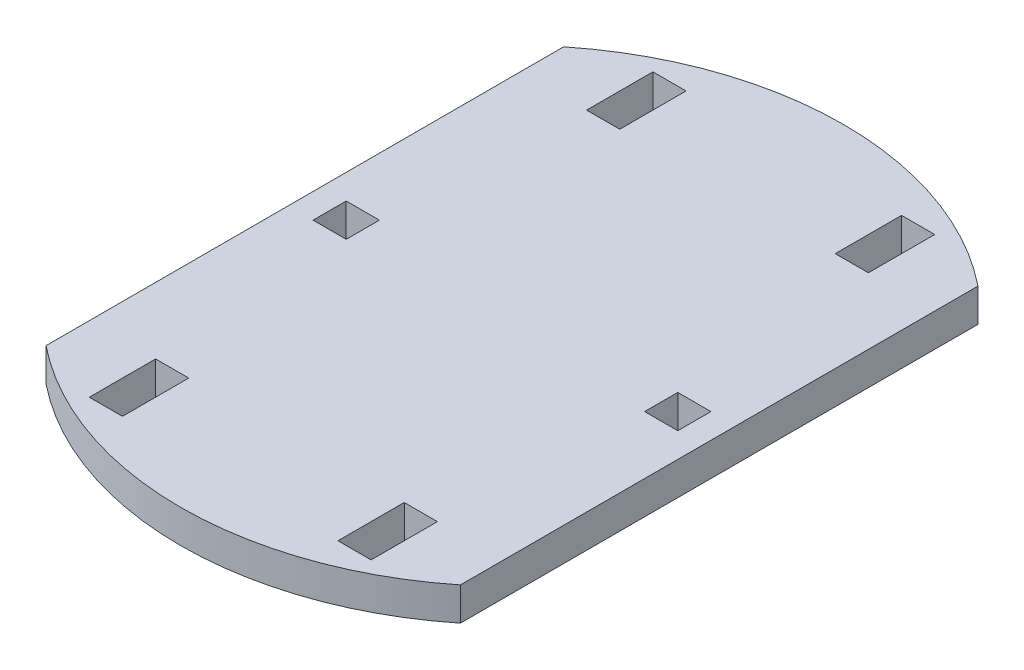
ISO-10303-21;
HEADER;
FILE_DESCRIPTION(('STEP AP214'),'2;1');
FILE_NAME('part.step','',(''),(''),'','','');
FILE_SCHEMA(('AUTOMOTIVE_DESIGN { 1 0 10303 214 1 1 1 1 }'));
ENDSEC;
DATA;
#1=APPLICATION_CONTEXT('core data for automotive mechanical design processes');
#2=APPLICATION_PROTOCOL_DEFINITION('international standard','automotive_design',2000,#1);
#3=PRODUCT_CONTEXT('',#1,'mechanical');
#4=PRODUCT('Part','Part','',(#3));
#5=PRODUCT_RELATED_PRODUCT_CATEGORY('part','',(#4));
#6=PRODUCT_DEFINITION_FORMATION('','',#4);
#7=PRODUCT_DEFINITION_CONTEXT('part definition',#1,'design');
#8=PRODUCT_DEFINITION('design','',#6,#7);
#9=PRODUCT_DEFINITION_SHAPE('','',#8);
#10=(LENGTH_UNIT() NAMED_UNIT(*) SI_UNIT(.MILLI.,.METRE.));
#11=(NAMED_UNIT(*) PLANE_ANGLE_UNIT() SI_UNIT($,.RADIAN.));
#12=(NAMED_UNIT(*) SI_UNIT($,.STERADIAN.) SOLID_ANGLE_UNIT());
#13=UNCERTAINTY_MEASURE_WITH_UNIT(LENGTH_MEASURE(1.E-05),#10,'distance_accuracy_value','');
#14=(GEOMETRIC_REPRESENTATION_CONTEXT(3) GLOBAL_UNCERTAINTY_ASSIGNED_CONTEXT((#13)) GLOBAL_UNIT_ASSIGNED_CONTEXT((#10,
#11,#12)) REPRESENTATION_CONTEXT('',''));
#15=CARTESIAN_POINT('',(0.,0.,0.));
#16=DIRECTION('',(0.,0.,1.));
#17=DIRECTION('',(1.,0.,0.));
#18=AXIS2_PLACEMENT_3D('',#15,#16,#17);
#19=CARTESIAN_POINT('',(25.,4.,0.));
#20=DIRECTION('',(1.,0.,0.));
#21=DIRECTION('',(0.,0.,-1.));
#22=AXIS2_PLACEMENT_3D('',#19,#20,#21);
#23=PLANE('',#22);
#24=DIRECTION('',(0.,0.,1.));
#25=VECTOR('',#24,1.);
#26=CARTESIAN_POINT('',(25.,0.,0.));
#27=LINE('',#26,#25);
#28=CARTESIAN_POINT('',(25.,0.,-31.224989991992));
#29=VERTEX_POINT('',#28);
#30=CARTESIAN_POINT('',(25.,0.,31.224989991992));
#31=VERTEX_POINT('',#30);
#32=EDGE_CURVE('E448',#29,#31,#27,.T.);
#33=ORIENTED_EDGE('',*,*,#32,.F.);
#34=DIRECTION('',(0.,-1.,0.));
#35=VECTOR('',#34,1.);
#36=CARTESIAN_POINT('',(25.,4.,-31.224989991992));
#37=LINE('',#36,#35);
#38=CARTESIAN_POINT('',(25.,4.,-31.224989991992));
#39=VERTEX_POINT('',#38);
#40=EDGE_CURVE('E11',#39,#29,#37,.T.);
#41=ORIENTED_EDGE('',*,*,#40,.F.);
#42=DIRECTION('',(0.,0.,1.));
#43=VECTOR('',#42,1.);
#44=CARTESIAN_POINT('',(25.,4.,0.));
#45=LINE('',#44,#43);
#46=CARTESIAN_POINT('',(25.,4.,31.224989991992));
#47=VERTEX_POINT('',#46);
#48=EDGE_CURVE('E252',#39,#47,#45,.T.);
#49=ORIENTED_EDGE('',*,*,#48,.T.);
#50=DIRECTION('',(0.,-1.,0.));
#51=VECTOR('',#50,1.);
#52=CARTESIAN_POINT('',(25.,4.,31.224989991992));
#53=LINE('',#52,#51);
#54=EDGE_CURVE('E157',#47,#31,#53,.T.);
#55=ORIENTED_EDGE('',*,*,#54,.T.);
#56=EDGE_LOOP('',(#33,#41,#49,#55));
#57=FACE_BOUND('',#56,.T.);
#58=ADVANCED_FACE('F43',(#57),#23,.T.);
#59=CARTESIAN_POINT('',(0.,4.,0.));
#60=DIRECTION('',(0.,-1.,0.));
#61=DIRECTION('',(0.,0.,-1.));
#62=AXIS2_PLACEMENT_3D('',#59,#60,#61);
#63=CYLINDRICAL_SURFACE('',#62,40.);
#64=CARTESIAN_POINT('',(0.,0.,0.));
#65=DIRECTION('',(0.,1.,0.));
#66=DIRECTION('',(0.,0.,1.));
#67=AXIS2_PLACEMENT_3D('',#64,#65,#66);
#68=CIRCLE('',#67,40.);
#69=CARTESIAN_POINT('',(-25.,0.,-31.224989991992));
#70=VERTEX_POINT('',#69);
#71=EDGE_CURVE('E258',#29,#70,#68,.T.);
#72=ORIENTED_EDGE('',*,*,#71,.T.);
#73=DIRECTION('',(0.,-1.,0.));
#74=VECTOR('',#73,1.);
#75=CARTESIAN_POINT('',(-25.,4.,-31.224989991992));
#76=LINE('',#75,#74);
#77=CARTESIAN_POINT('',(-25.,4.,-31.224989991992));
#78=VERTEX_POINT('',#77);
#79=EDGE_CURVE('E54',#78,#70,#76,.T.);
#80=ORIENTED_EDGE('',*,*,#79,.F.);
#81=CARTESIAN_POINT('',(0.,4.,0.));
#82=DIRECTION('',(0.,1.,0.));
#83=DIRECTION('',(0.,0.,1.));
#84=AXIS2_PLACEMENT_3D('',#81,#82,#83);
#85=CIRCLE('',#84,40.);
#86=EDGE_CURVE('E248',#39,#78,#85,.T.);
#87=ORIENTED_EDGE('',*,*,#86,.F.);
#88=ORIENTED_EDGE('',*,*,#40,.T.);
#89=EDGE_LOOP('',(#72,#80,#87,#88));
#90=FACE_BOUND('',#89,.T.);
#91=ADVANCED_FACE('F256',(#90),#63,.T.);
#92=CARTESIAN_POINT('',(-25.,4.,0.));
#93=DIRECTION('',(1.,0.,0.));
#94=DIRECTION('',(0.,0.,-1.));
#95=AXIS2_PLACEMENT_3D('',#92,#93,#94);
#96=PLANE('',#95);
#97=DIRECTION('',(0.,0.,1.));
#98=VECTOR('',#97,1.);
#99=CARTESIAN_POINT('',(-25.,0.,0.));
#100=LINE('',#99,#98);
#101=CARTESIAN_POINT('',(-25.,0.,31.224989991992));
#102=VERTEX_POINT('',#101);
#103=EDGE_CURVE('E453',#70,#102,#100,.T.);
#104=ORIENTED_EDGE('',*,*,#103,.T.);
#105=DIRECTION('',(0.,-1.,0.));
#106=VECTOR('',#105,1.);
#107=CARTESIAN_POINT('',(-25.,4.,31.224989991992));
#108=LINE('',#107,#106);
#109=CARTESIAN_POINT('',(-25.,4.,31.224989991992));
#110=VERTEX_POINT('',#109);
#111=EDGE_CURVE('E246',#110,#102,#108,.T.);
#112=ORIENTED_EDGE('',*,*,#111,.F.);
#113=DIRECTION('',(0.,0.,1.));
#114=VECTOR('',#113,1.);
#115=CARTESIAN_POINT('',(-25.,4.,0.));
#116=LINE('',#115,#114);
#117=EDGE_CURVE('E240',#78,#110,#116,.T.);
#118=ORIENTED_EDGE('',*,*,#117,.F.);
#119=ORIENTED_EDGE('',*,*,#79,.T.);
#120=EDGE_LOOP('',(#104,#112,#118,#119));
#121=FACE_BOUND('',#120,.T.);
#122=ADVANCED_FACE('F243',(#121),#96,.F.);
#123=CARTESIAN_POINT('',(0.,4.,26.));
#124=DIRECTION('',(0.,0.,1.));
#125=DIRECTION('',(1.,0.,0.));
#126=AXIS2_PLACEMENT_3D('',#123,#124,#125);
#127=PLANE('',#126);
#128=DIRECTION('',(-1.,0.,0.));
#129=VECTOR('',#128,1.);
#130=CARTESIAN_POINT('',(0.,0.,26.));
#131=LINE('',#130,#129);
#132=CARTESIAN_POINT('',(-13.,0.,26.));
#133=VERTEX_POINT('',#132);
#134=CARTESIAN_POINT('',(-17.,0.,26.));
#135=VERTEX_POINT('',#134);
#136=EDGE_CURVE('E432',#133,#135,#131,.T.);
#137=ORIENTED_EDGE('',*,*,#136,.F.);
#138=DIRECTION('',(0.,-1.,0.));
#139=VECTOR('',#138,1.);
#140=CARTESIAN_POINT('',(-13.,4.,26.));
#141=LINE('',#140,#139);
#142=CARTESIAN_POINT('',(-13.,4.,26.));
#143=VERTEX_POINT('',#142);
#144=EDGE_CURVE('E276',#143,#133,#141,.T.);
#145=ORIENTED_EDGE('',*,*,#144,.F.);
#146=DIRECTION('',(-1.,0.,0.));
#147=VECTOR('',#146,1.);
#148=CARTESIAN_POINT('',(0.,4.,26.));
#149=LINE('',#148,#147);
#150=CARTESIAN_POINT('',(-17.,4.,26.));
#151=VERTEX_POINT('',#150);
#152=EDGE_CURVE('E532',#143,#151,#149,.T.);
#153=ORIENTED_EDGE('',*,*,#152,.T.);
#154=DIRECTION('',(0.,-1.,0.));
#155=VECTOR('',#154,1.);
#156=CARTESIAN_POINT('',(-17.,4.,26.));
#157=LINE('',#156,#155);
#158=EDGE_CURVE('E265',#151,#135,#157,.T.);
#159=ORIENTED_EDGE('',*,*,#158,.T.);
#160=EDGE_LOOP('',(#137,#145,#153,#159));
#161=FACE_BOUND('',#160,.T.);
#162=ADVANCED_FACE('F578',(#161),#127,.T.);
#163=CARTESIAN_POINT('',(-13.,4.,0.));
#164=DIRECTION('',(-1.,0.,0.));
#165=DIRECTION('',(0.,0.,1.));
#166=AXIS2_PLACEMENT_3D('',#163,#164,#165);
#167=PLANE('',#166);
#168=DIRECTION('',(0.,0.,-1.));
#169=VECTOR('',#168,1.);
#170=CARTESIAN_POINT('',(-13.,0.,0.));
#171=LINE('',#170,#169);
#172=CARTESIAN_POINT('',(-13.,0.,34.));
#173=VERTEX_POINT('',#172);
#174=EDGE_CURVE('E436',#173,#133,#171,.T.);
#175=ORIENTED_EDGE('',*,*,#174,.F.);
#176=DIRECTION('',(0.,-1.,0.));
#177=VECTOR('',#176,1.);
#178=CARTESIAN_POINT('',(-13.,4.,34.));
#179=LINE('',#178,#177);
#180=CARTESIAN_POINT('',(-13.,4.,34.));
#181=VERTEX_POINT('',#180);
#182=EDGE_CURVE('E273',#181,#173,#179,.T.);
#183=ORIENTED_EDGE('',*,*,#182,.F.);
#184=DIRECTION('',(0.,0.,-1.));
#185=VECTOR('',#184,1.);
#186=CARTESIAN_POINT('',(-13.,4.,0.));
#187=LINE('',#186,#185);
#188=EDGE_CURVE('E536',#181,#143,#187,.T.);
#189=ORIENTED_EDGE('',*,*,#188,.T.);
#190=ORIENTED_EDGE('',*,*,#144,.T.);
#191=EDGE_LOOP('',(#175,#183,#189,#190));
#192=FACE_BOUND('',#191,.T.);
#193=ADVANCED_FACE('F574',(#192),#167,.T.);
#194=CARTESIAN_POINT('',(0.,4.,34.));
#195=DIRECTION('',(0.,0.,1.));
#196=DIRECTION('',(1.,0.,0.));
#197=AXIS2_PLACEMENT_3D('',#194,#195,#196);
#198=PLANE('',#197);
#199=DIRECTION('',(-1.,0.,0.));
#200=VECTOR('',#199,1.);
#201=CARTESIAN_POINT('',(0.,0.,34.));
#202=LINE('',#201,#200);
#203=CARTESIAN_POINT('',(-17.,0.,34.));
#204=VERTEX_POINT('',#203);
#205=EDGE_CURVE('E440',#173,#204,#202,.T.);
#206=ORIENTED_EDGE('',*,*,#205,.T.);
#207=DIRECTION('',(0.,-1.,0.));
#208=VECTOR('',#207,1.);
#209=CARTESIAN_POINT('',(-17.,4.,34.));
#210=LINE('',#209,#208);
#211=CARTESIAN_POINT('',(-17.,4.,34.));
#212=VERTEX_POINT('',#211);
#213=EDGE_CURVE('E268',#212,#204,#210,.T.);
#214=ORIENTED_EDGE('',*,*,#213,.F.);
#215=DIRECTION('',(-1.,0.,0.));
#216=VECTOR('',#215,1.);
#217=CARTESIAN_POINT('',(0.,4.,34.));
#218=LINE('',#217,#216);
#219=EDGE_CURVE('E540',#181,#212,#218,.T.);
#220=ORIENTED_EDGE('',*,*,#219,.F.);
#221=ORIENTED_EDGE('',*,*,#182,.T.);
#222=EDGE_LOOP('',(#206,#214,#220,#221));
#223=FACE_BOUND('',#222,.T.);
#224=ADVANCED_FACE('F570',(#223),#198,.F.);
#225=CARTESIAN_POINT('',(0.,4.,-2.));
#226=DIRECTION('',(0.,0.,-1.));
#227=DIRECTION('',(-1.,0.,0.));
#228=AXIS2_PLACEMENT_3D('',#225,#226,#227);
#229=PLANE('',#228);
#230=DIRECTION('',(1.,0.,0.));
#231=VECTOR('',#230,1.);
#232=CARTESIAN_POINT('',(0.,0.,-2.));
#233=LINE('',#232,#231);
#234=CARTESIAN_POINT('',(18.,0.,-2.));
#235=VERTEX_POINT('',#234);
#236=CARTESIAN_POINT('',(22.,0.,-2.));
#237=VERTEX_POINT('',#236);
#238=EDGE_CURVE('E416',#235,#237,#233,.T.);
#239=ORIENTED_EDGE('',*,*,#238,.T.);
#240=DIRECTION('',(0.,-1.,0.));
#241=VECTOR('',#240,1.);
#242=CARTESIAN_POINT('',(22.,4.,-2.));
#243=LINE('',#242,#241);
#244=CARTESIAN_POINT('',(22.,4.,-2.));
#245=VERTEX_POINT('',#244);
#246=EDGE_CURVE('E269',#245,#237,#243,.T.);
#247=ORIENTED_EDGE('',*,*,#246,.F.);
#248=DIRECTION('',(1.,0.,0.));
#249=VECTOR('',#248,1.);
#250=CARTESIAN_POINT('',(0.,4.,-2.));
#251=LINE('',#250,#249);
#252=CARTESIAN_POINT('',(18.,4.,-2.));
#253=VERTEX_POINT('',#252);
#254=EDGE_CURVE('E517',#253,#245,#251,.T.);
#255=ORIENTED_EDGE('',*,*,#254,.F.);
#256=DIRECTION('',(0.,-1.,0.));
#257=VECTOR('',#256,1.);
#258=CARTESIAN_POINT('',(18.,4.,-2.));
#259=LINE('',#258,#257);
#260=EDGE_CURVE('E279',#253,#235,#259,.T.);
#261=ORIENTED_EDGE('',*,*,#260,.T.);
#262=EDGE_LOOP('',(#239,#247,#255,#261));
#263=FACE_BOUND('',#262,.T.);
#264=ADVANCED_FACE('F573',(#263),#229,.F.);
#265=CARTESIAN_POINT('',(22.,4.,0.));
#266=DIRECTION('',(1.,0.,0.));
#267=DIRECTION('',(0.,0.,-1.));
#268=AXIS2_PLACEMENT_3D('',#265,#266,#267);
#269=PLANE('',#268);
#270=DIRECTION('',(0.,0.,1.));
#271=VECTOR('',#270,1.);
#272=CARTESIAN_POINT('',(22.,0.,0.));
#273=LINE('',#272,#271);
#274=CARTESIAN_POINT('',(22.,0.,2.));
#275=VERTEX_POINT('',#274);
#276=EDGE_CURVE('E420',#237,#275,#273,.T.);
#277=ORIENTED_EDGE('',*,*,#276,.T.);
#278=DIRECTION('',(0.,-1.,0.));
#279=VECTOR('',#278,1.);
#280=CARTESIAN_POINT('',(22.,4.,2.));
#281=LINE('',#280,#279);
#282=CARTESIAN_POINT('',(22.,4.,2.));
#283=VERTEX_POINT('',#282);
#284=EDGE_CURVE('E286',#283,#275,#281,.T.);
#285=ORIENTED_EDGE('',*,*,#284,.F.);
#286=DIRECTION('',(0.,0.,1.));
#287=VECTOR('',#286,1.);
#288=CARTESIAN_POINT('',(22.,4.,0.));
#289=LINE('',#288,#287);
#290=EDGE_CURVE('E521',#245,#283,#289,.T.);
#291=ORIENTED_EDGE('',*,*,#290,.F.);
#292=ORIENTED_EDGE('',*,*,#246,.T.);
#293=EDGE_LOOP('',(#277,#285,#291,#292));
#294=FACE_BOUND('',#293,.T.);
#295=ADVANCED_FACE('F591',(#294),#269,.F.);
#296=CARTESIAN_POINT('',(0.,4.,2.));
#297=DIRECTION('',(0.,0.,-1.));
#298=DIRECTION('',(-1.,0.,0.));
#299=AXIS2_PLACEMENT_3D('',#296,#297,#298);
#300=PLANE('',#299);
#301=DIRECTION('',(1.,0.,0.));
#302=VECTOR('',#301,1.);
#303=CARTESIAN_POINT('',(0.,0.,2.));
#304=LINE('',#303,#302);
#305=CARTESIAN_POINT('',(18.,0.,2.));
#306=VERTEX_POINT('',#305);
#307=EDGE_CURVE('E424',#306,#275,#304,.T.);
#308=ORIENTED_EDGE('',*,*,#307,.F.);
#309=DIRECTION('',(0.,-1.,0.));
#310=VECTOR('',#309,1.);
#311=CARTESIAN_POINT('',(18.,4.,2.));
#312=LINE('',#311,#310);
#313=CARTESIAN_POINT('',(18.,4.,2.));
#314=VERTEX_POINT('',#313);
#315=EDGE_CURVE('E282',#314,#306,#312,.T.);
#316=ORIENTED_EDGE('',*,*,#315,.F.);
#317=DIRECTION('',(1.,0.,0.));
#318=VECTOR('',#317,1.);
#319=CARTESIAN_POINT('',(0.,4.,2.));
#320=LINE('',#319,#318);
#321=EDGE_CURVE('E524',#314,#283,#320,.T.);
#322=ORIENTED_EDGE('',*,*,#321,.T.);
#323=ORIENTED_EDGE('',*,*,#284,.T.);
#324=EDGE_LOOP('',(#308,#316,#322,#323));
#325=FACE_BOUND('',#324,.T.);
#326=ADVANCED_FACE('F587',(#325),#300,.T.);
#327=CARTESIAN_POINT('',(0.,4.,-2.));
#328=DIRECTION('',(0.,0.,1.));
#329=DIRECTION('',(1.,0.,0.));
#330=AXIS2_PLACEMENT_3D('',#327,#328,#329);
#331=PLANE('',#330);
#332=DIRECTION('',(-1.,0.,0.));
#333=VECTOR('',#332,1.);
#334=CARTESIAN_POINT('',(0.,0.,-2.));
#335=LINE('',#334,#333);
#336=CARTESIAN_POINT('',(-18.,0.,-2.));
#337=VERTEX_POINT('',#336);
#338=CARTESIAN_POINT('',(-22.,0.,-2.));
#339=VERTEX_POINT('',#338);
#340=EDGE_CURVE('E400',#337,#339,#335,.T.);
#341=ORIENTED_EDGE('',*,*,#340,.F.);
#342=DIRECTION('',(0.,-1.,0.));
#343=VECTOR('',#342,1.);
#344=CARTESIAN_POINT('',(-18.,4.,-2.));
#345=LINE('',#344,#343);
#346=CARTESIAN_POINT('',(-18.,4.,-2.));
#347=VERTEX_POINT('',#346);
#348=EDGE_CURVE('E283',#347,#337,#345,.T.);
#349=ORIENTED_EDGE('',*,*,#348,.F.);
#350=DIRECTION('',(-1.,0.,0.));
#351=VECTOR('',#350,1.);
#352=CARTESIAN_POINT('',(0.,4.,-2.));
#353=LINE('',#352,#351);
#354=CARTESIAN_POINT('',(-22.,4.,-2.));
#355=VERTEX_POINT('',#354);
#356=EDGE_CURVE('E502',#347,#355,#353,.T.);
#357=ORIENTED_EDGE('',*,*,#356,.T.);
#358=DIRECTION('',(0.,-1.,0.));
#359=VECTOR('',#358,1.);
#360=CARTESIAN_POINT('',(-22.,4.,-2.));
#361=LINE('',#360,#359);
#362=EDGE_CURVE('E292',#355,#339,#361,.T.);
#363=ORIENTED_EDGE('',*,*,#362,.T.);
#364=EDGE_LOOP('',(#341,#349,#357,#363));
#365=FACE_BOUND('',#364,.T.);
#366=ADVANCED_FACE('F590',(#365),#331,.T.);
#367=CARTESIAN_POINT('',(-18.,4.,0.));
#368=DIRECTION('',(1.,0.,0.));
#369=DIRECTION('',(0.,0.,-1.));
#370=AXIS2_PLACEMENT_3D('',#367,#368,#369);
#371=PLANE('',#370);
#372=DIRECTION('',(0.,0.,1.));
#373=VECTOR('',#372,1.);
#374=CARTESIAN_POINT('',(-18.,0.,0.));
#375=LINE('',#374,#373);
#376=CARTESIAN_POINT('',(-18.,0.,2.));
#377=VERTEX_POINT('',#376);
#378=EDGE_CURVE('E404',#337,#377,#375,.T.);
#379=ORIENTED_EDGE('',*,*,#378,.T.);
#380=DIRECTION('',(0.,-1.,0.));
#381=VECTOR('',#380,1.);
#382=CARTESIAN_POINT('',(-18.,4.,2.));
#383=LINE('',#382,#381);
#384=CARTESIAN_POINT('',(-18.,4.,2.));
#385=VERTEX_POINT('',#384);
#386=EDGE_CURVE('E299',#385,#377,#383,.T.);
#387=ORIENTED_EDGE('',*,*,#386,.F.);
#388=DIRECTION('',(0.,0.,1.));
#389=VECTOR('',#388,1.);
#390=CARTESIAN_POINT('',(-18.,4.,0.));
#391=LINE('',#390,#389);
#392=EDGE_CURVE('E506',#347,#385,#391,.T.);
#393=ORIENTED_EDGE('',*,*,#392,.F.);
#394=ORIENTED_EDGE('',*,*,#348,.T.);
#395=EDGE_LOOP('',(#379,#387,#393,#394));
#396=FACE_BOUND('',#395,.T.);
#397=ADVANCED_FACE('F607',(#396),#371,.F.);
#398=CARTESIAN_POINT('',(0.,4.,2.));
#399=DIRECTION('',(0.,0.,1.));
#400=DIRECTION('',(1.,0.,0.));
#401=AXIS2_PLACEMENT_3D('',#398,#399,#400);
#402=PLANE('',#401);
#403=DIRECTION('',(-1.,0.,0.));
#404=VECTOR('',#403,1.);
#405=CARTESIAN_POINT('',(0.,0.,2.));
#406=LINE('',#405,#404);
#407=CARTESIAN_POINT('',(-22.,0.,2.));
#408=VERTEX_POINT('',#407);
#409=EDGE_CURVE('E408',#377,#408,#406,.T.);
#410=ORIENTED_EDGE('',*,*,#409,.T.);
#411=DIRECTION('',(0.,-1.,0.));
#412=VECTOR('',#411,1.);
#413=CARTESIAN_POINT('',(-22.,4.,2.));
#414=LINE('',#413,#412);
#415=CARTESIAN_POINT('',(-22.,4.,2.));
#416=VERTEX_POINT('',#415);
#417=EDGE_CURVE('E295',#416,#408,#414,.T.);
#418=ORIENTED_EDGE('',*,*,#417,.F.);
#419=DIRECTION('',(-1.,0.,0.));
#420=VECTOR('',#419,1.);
#421=CARTESIAN_POINT('',(0.,4.,2.));
#422=LINE('',#421,#420);
#423=EDGE_CURVE('E510',#385,#416,#422,.T.);
#424=ORIENTED_EDGE('',*,*,#423,.F.);
#425=ORIENTED_EDGE('',*,*,#386,.T.);
#426=EDGE_LOOP('',(#410,#418,#424,#425));
#427=FACE_BOUND('',#426,.T.);
#428=ADVANCED_FACE('F603',(#427),#402,.F.);
#429=CARTESIAN_POINT('',(0.,4.,-34.));
#430=DIRECTION('',(0.,0.,-1.));
#431=DIRECTION('',(-1.,0.,0.));
#432=AXIS2_PLACEMENT_3D('',#429,#430,#431);
#433=PLANE('',#432);
#434=DIRECTION('',(1.,0.,0.));
#435=VECTOR('',#434,1.);
#436=CARTESIAN_POINT('',(0.,0.,-34.));
#437=LINE('',#436,#435);
#438=CARTESIAN_POINT('',(13.,0.,-34.));
#439=VERTEX_POINT('',#438);
#440=CARTESIAN_POINT('',(17.,0.,-34.));
#441=VERTEX_POINT('',#440);
#442=EDGE_CURVE('E384',#439,#441,#437,.T.);
#443=ORIENTED_EDGE('',*,*,#442,.T.);
#444=DIRECTION('',(0.,-1.,0.));
#445=VECTOR('',#444,1.);
#446=CARTESIAN_POINT('',(17.,4.,-34.));
#447=LINE('',#446,#445);
#448=CARTESIAN_POINT('',(17.,4.,-34.));
#449=VERTEX_POINT('',#448);
#450=EDGE_CURVE('E296',#449,#441,#447,.T.);
#451=ORIENTED_EDGE('',*,*,#450,.F.);
#452=DIRECTION('',(1.,0.,0.));
#453=VECTOR('',#452,1.);
#454=CARTESIAN_POINT('',(0.,4.,-34.));
#455=LINE('',#454,#453);
#456=CARTESIAN_POINT('',(13.,4.,-34.));
#457=VERTEX_POINT('',#456);
#458=EDGE_CURVE('E487',#457,#449,#455,.T.);
#459=ORIENTED_EDGE('',*,*,#458,.F.);
#460=DIRECTION('',(0.,-1.,0.));
#461=VECTOR('',#460,1.);
#462=CARTESIAN_POINT('',(13.,4.,-34.));
#463=LINE('',#462,#461);
#464=EDGE_CURVE('E305',#457,#439,#463,.T.);
#465=ORIENTED_EDGE('',*,*,#464,.T.);
#466=EDGE_LOOP('',(#443,#451,#459,#465));
#467=FACE_BOUND('',#466,.T.);
#468=ADVANCED_FACE('F606',(#467),#433,.F.);
#469=CARTESIAN_POINT('',(17.,4.,0.));
#470=DIRECTION('',(1.,0.,0.));
#471=DIRECTION('',(0.,0.,-1.));
#472=AXIS2_PLACEMENT_3D('',#469,#470,#471);
#473=PLANE('',#472);
#474=DIRECTION('',(0.,0.,1.));
#475=VECTOR('',#474,1.);
#476=CARTESIAN_POINT('',(17.,0.,0.));
#477=LINE('',#476,#475);
#478=CARTESIAN_POINT('',(17.,0.,-26.));
#479=VERTEX_POINT('',#478);
#480=EDGE_CURVE('E388',#441,#479,#477,.T.);
#481=ORIENTED_EDGE('',*,*,#480,.T.);
#482=DIRECTION('',(0.,-1.,0.));
#483=VECTOR('',#482,1.);
#484=CARTESIAN_POINT('',(17.,4.,-26.));
#485=LINE('',#484,#483);
#486=CARTESIAN_POINT('',(17.,4.,-26.));
#487=VERTEX_POINT('',#486);
#488=EDGE_CURVE('E312',#487,#479,#485,.T.);
#489=ORIENTED_EDGE('',*,*,#488,.F.);
#490=DIRECTION('',(0.,0.,1.));
#491=VECTOR('',#490,1.);
#492=CARTESIAN_POINT('',(17.,4.,0.));
#493=LINE('',#492,#491);
#494=EDGE_CURVE('E491',#449,#487,#493,.T.);
#495=ORIENTED_EDGE('',*,*,#494,.F.);
#496=ORIENTED_EDGE('',*,*,#450,.T.);
#497=EDGE_LOOP('',(#481,#489,#495,#496));
#498=FACE_BOUND('',#497,.T.);
#499=ADVANCED_FACE('F623',(#498),#473,.F.);
#500=CARTESIAN_POINT('',(0.,4.,-26.));
#501=DIRECTION('',(0.,0.,-1.));
#502=DIRECTION('',(-1.,0.,0.));
#503=AXIS2_PLACEMENT_3D('',#500,#501,#502);
#504=PLANE('',#503);
#505=DIRECTION('',(1.,0.,0.));
#506=VECTOR('',#505,1.);
#507=CARTESIAN_POINT('',(0.,0.,-26.));
#508=LINE('',#507,#506);
#509=CARTESIAN_POINT('',(13.,0.,-26.));
#510=VERTEX_POINT('',#509);
#511=EDGE_CURVE('E392',#510,#479,#508,.T.);
#512=ORIENTED_EDGE('',*,*,#511,.F.);
#513=DIRECTION('',(0.,-1.,0.));
#514=VECTOR('',#513,1.);
#515=CARTESIAN_POINT('',(13.,4.,-26.));
#516=LINE('',#515,#514);
#517=CARTESIAN_POINT('',(13.,4.,-26.));
#518=VERTEX_POINT('',#517);
#519=EDGE_CURVE('E308',#518,#510,#516,.T.);
#520=ORIENTED_EDGE('',*,*,#519,.F.);
#521=DIRECTION('',(1.,0.,0.));
#522=VECTOR('',#521,1.);
#523=CARTESIAN_POINT('',(0.,4.,-26.));
#524=LINE('',#523,#522);
#525=EDGE_CURVE('E494',#518,#487,#524,.T.);
#526=ORIENTED_EDGE('',*,*,#525,.T.);
#527=ORIENTED_EDGE('',*,*,#488,.T.);
#528=EDGE_LOOP('',(#512,#520,#526,#527));
#529=FACE_BOUND('',#528,.T.);
#530=ADVANCED_FACE('F619',(#529),#504,.T.);
#531=CARTESIAN_POINT('',(0.,4.,-34.));
#532=DIRECTION('',(0.,0.,1.));
#533=DIRECTION('',(1.,0.,0.));
#534=AXIS2_PLACEMENT_3D('',#531,#532,#533);
#535=PLANE('',#534);
#536=DIRECTION('',(-1.,0.,0.));
#537=VECTOR('',#536,1.);
#538=CARTESIAN_POINT('',(0.,0.,-34.));
#539=LINE('',#538,#537);
#540=CARTESIAN_POINT('',(-13.,0.,-34.));
#541=VERTEX_POINT('',#540);
#542=CARTESIAN_POINT('',(-17.,0.,-34.));
#543=VERTEX_POINT('',#542);
#544=EDGE_CURVE('E368',#541,#543,#539,.T.);
#545=ORIENTED_EDGE('',*,*,#544,.F.);
#546=DIRECTION('',(0.,-1.,0.));
#547=VECTOR('',#546,1.);
#548=CARTESIAN_POINT('',(-13.,4.,-34.));
#549=LINE('',#548,#547);
#550=CARTESIAN_POINT('',(-13.,4.,-34.));
#551=VERTEX_POINT('',#550);
#552=EDGE_CURVE('E309',#551,#541,#549,.T.);
#553=ORIENTED_EDGE('',*,*,#552,.F.);
#554=DIRECTION('',(-1.,0.,0.));
#555=VECTOR('',#554,1.);
#556=CARTESIAN_POINT('',(0.,4.,-34.));
#557=LINE('',#556,#555);
#558=CARTESIAN_POINT('',(-17.,4.,-34.));
#559=VERTEX_POINT('',#558);
#560=EDGE_CURVE('E472',#551,#559,#557,.T.);
#561=ORIENTED_EDGE('',*,*,#560,.T.);
#562=DIRECTION('',(0.,-1.,0.));
#563=VECTOR('',#562,1.);
#564=CARTESIAN_POINT('',(-17.,4.,-34.));
#565=LINE('',#564,#563);
#566=EDGE_CURVE('E318',#559,#543,#565,.T.);
#567=ORIENTED_EDGE('',*,*,#566,.T.);
#568=EDGE_LOOP('',(#545,#553,#561,#567));
#569=FACE_BOUND('',#568,.T.);
#570=ADVANCED_FACE('F622',(#569),#535,.T.);
#571=CARTESIAN_POINT('',(-13.,4.,0.));
#572=DIRECTION('',(1.,0.,0.));
#573=DIRECTION('',(0.,0.,-1.));
#574=AXIS2_PLACEMENT_3D('',#571,#572,#573);
#575=PLANE('',#574);
#576=DIRECTION('',(0.,0.,1.));
#577=VECTOR('',#576,1.);
#578=CARTESIAN_POINT('',(-13.,0.,0.));
#579=LINE('',#578,#577);
#580=CARTESIAN_POINT('',(-13.,0.,-26.));
#581=VERTEX_POINT('',#580);
#582=EDGE_CURVE('E372',#541,#581,#579,.T.);
#583=ORIENTED_EDGE('',*,*,#582,.T.);
#584=DIRECTION('',(0.,-1.,0.));
#585=VECTOR('',#584,1.);
#586=CARTESIAN_POINT('',(-13.,4.,-26.));
#587=LINE('',#586,#585);
#588=CARTESIAN_POINT('',(-13.,4.,-26.));
#589=VERTEX_POINT('',#588);
#590=EDGE_CURVE('E324',#589,#581,#587,.T.);
#591=ORIENTED_EDGE('',*,*,#590,.F.);
#592=DIRECTION('',(0.,0.,1.));
#593=VECTOR('',#592,1.);
#594=CARTESIAN_POINT('',(-13.,4.,0.));
#595=LINE('',#594,#593);
#596=EDGE_CURVE('E476',#551,#589,#595,.T.);
#597=ORIENTED_EDGE('',*,*,#596,.F.);
#598=ORIENTED_EDGE('',*,*,#552,.T.);
#599=EDGE_LOOP('',(#583,#591,#597,#598));
#600=FACE_BOUND('',#599,.T.);
#601=ADVANCED_FACE('F638',(#600),#575,.F.);
#602=CARTESIAN_POINT('',(0.,4.,-26.));
#603=DIRECTION('',(0.,0.,1.));
#604=DIRECTION('',(1.,0.,0.));
#605=AXIS2_PLACEMENT_3D('',#602,#603,#604);
#606=PLANE('',#605);
#607=DIRECTION('',(-1.,0.,0.));
#608=VECTOR('',#607,1.);
#609=CARTESIAN_POINT('',(0.,0.,-26.));
#610=LINE('',#609,#608);
#611=CARTESIAN_POINT('',(-17.,0.,-26.));
#612=VERTEX_POINT('',#611);
#613=EDGE_CURVE('E376',#581,#612,#610,.T.);
#614=ORIENTED_EDGE('',*,*,#613,.T.);
#615=DIRECTION('',(0.,-1.,0.));
#616=VECTOR('',#615,1.);
#617=CARTESIAN_POINT('',(-17.,4.,-26.));
#618=LINE('',#617,#616);
#619=CARTESIAN_POINT('',(-17.,4.,-26.));
#620=VERTEX_POINT('',#619);
#621=EDGE_CURVE('E321',#620,#612,#618,.T.);
#622=ORIENTED_EDGE('',*,*,#621,.F.);
#623=DIRECTION('',(-1.,0.,0.));
#624=VECTOR('',#623,1.);
#625=CARTESIAN_POINT('',(0.,4.,-26.));
#626=LINE('',#625,#624);
#627=EDGE_CURVE('E480',#589,#620,#626,.T.);
#628=ORIENTED_EDGE('',*,*,#627,.F.);
#629=ORIENTED_EDGE('',*,*,#590,.T.);
#630=EDGE_LOOP('',(#614,#622,#628,#629));
#631=FACE_BOUND('',#630,.T.);
#632=ADVANCED_FACE('F635',(#631),#606,.F.);
#633=CARTESIAN_POINT('',(0.,4.,34.));
#634=DIRECTION('',(0.,0.,-1.));
#635=DIRECTION('',(-1.,0.,0.));
#636=AXIS2_PLACEMENT_3D('',#633,#634,#635);
#637=PLANE('',#636);
#638=DIRECTION('',(1.,0.,0.));
#639=VECTOR('',#638,1.);
#640=CARTESIAN_POINT('',(0.,0.,34.));
#641=LINE('',#640,#639);
#642=CARTESIAN_POINT('',(13.,0.,34.));
#643=VERTEX_POINT('',#642);
#644=CARTESIAN_POINT('',(17.,0.,34.));
#645=VERTEX_POINT('',#644);
#646=EDGE_CURVE('E355',#643,#645,#641,.T.);
#647=ORIENTED_EDGE('',*,*,#646,.F.);
#648=DIRECTION('',(0.,-1.,0.));
#649=VECTOR('',#648,1.);
#650=CARTESIAN_POINT('',(13.,4.,34.));
#651=LINE('',#650,#649);
#652=CARTESIAN_POINT('',(13.,4.,34.));
#653=VERTEX_POINT('',#652);
#654=EDGE_CURVE('E47',#653,#643,#651,.T.);
#655=ORIENTED_EDGE('',*,*,#654,.F.);
#656=DIRECTION('',(1.,0.,0.));
#657=VECTOR('',#656,1.);
#658=CARTESIAN_POINT('',(0.,4.,34.));
#659=LINE('',#658,#657);
#660=CARTESIAN_POINT('',(17.,4.,34.));
#661=VERTEX_POINT('',#660);
#662=EDGE_CURVE('E457',#653,#661,#659,.T.);
#663=ORIENTED_EDGE('',*,*,#662,.T.);
#664=DIRECTION('',(0.,-1.,0.));
#665=VECTOR('',#664,1.);
#666=CARTESIAN_POINT('',(17.,4.,34.));
#667=LINE('',#666,#665);
#668=EDGE_CURVE('E330',#661,#645,#667,.T.);
#669=ORIENTED_EDGE('',*,*,#668,.T.);
#670=EDGE_LOOP('',(#647,#655,#663,#669));
#671=FACE_BOUND('',#670,.T.);
#672=ADVANCED_FACE('F45',(#671),#637,.T.);
#673=CARTESIAN_POINT('',(13.,4.,0.));
#674=DIRECTION('',(-1.,0.,0.));
#675=DIRECTION('',(0.,0.,1.));
#676=AXIS2_PLACEMENT_3D('',#673,#674,#675);
#677=PLANE('',#676);
#678=DIRECTION('',(0.,0.,-1.));
#679=VECTOR('',#678,1.);
#680=CARTESIAN_POINT('',(13.,0.,0.));
#681=LINE('',#680,#679);
#682=CARTESIAN_POINT('',(13.,0.,26.));
#683=VERTEX_POINT('',#682);
#684=EDGE_CURVE('E347',#643,#683,#681,.T.);
#685=ORIENTED_EDGE('',*,*,#684,.T.);
#686=DIRECTION('',(0.,-1.,0.));
#687=VECTOR('',#686,1.);
#688=CARTESIAN_POINT('',(13.,4.,26.));
#689=LINE('',#688,#687);
#690=CARTESIAN_POINT('',(13.,4.,26.));
#691=VERTEX_POINT('',#690);
#692=EDGE_CURVE('E335',#691,#683,#689,.T.);
#693=ORIENTED_EDGE('',*,*,#692,.F.);
#694=DIRECTION('',(0.,0.,-1.));
#695=VECTOR('',#694,1.);
#696=CARTESIAN_POINT('',(13.,4.,0.));
#697=LINE('',#696,#695);
#698=EDGE_CURVE('E348',#653,#691,#697,.T.);
#699=ORIENTED_EDGE('',*,*,#698,.F.);
#700=ORIENTED_EDGE('',*,*,#654,.T.);
#701=EDGE_LOOP('',(#685,#693,#699,#700));
#702=FACE_BOUND('',#701,.T.);
#703=ADVANCED_FACE('F346',(#702),#677,.F.);
#704=CARTESIAN_POINT('',(0.,4.,26.));
#705=DIRECTION('',(0.,0.,-1.));
#706=DIRECTION('',(-1.,0.,0.));
#707=AXIS2_PLACEMENT_3D('',#704,#705,#706);
#708=PLANE('',#707);
#709=DIRECTION('',(1.,0.,0.));
#710=VECTOR('',#709,1.);
#711=CARTESIAN_POINT('',(0.,0.,26.));
#712=LINE('',#711,#710);
#713=CARTESIAN_POINT('',(17.,0.,26.));
#714=VERTEX_POINT('',#713);
#715=EDGE_CURVE('E357',#683,#714,#712,.T.);
#716=ORIENTED_EDGE('',*,*,#715,.T.);
#717=DIRECTION('',(0.,-1.,0.));
#718=VECTOR('',#717,1.);
#719=CARTESIAN_POINT('',(17.,4.,26.));
#720=LINE('',#719,#718);
#721=CARTESIAN_POINT('',(17.,4.,26.));
#722=VERTEX_POINT('',#721);
#723=EDGE_CURVE('E333',#722,#714,#720,.T.);
#724=ORIENTED_EDGE('',*,*,#723,.F.);
#725=DIRECTION('',(1.,0.,0.));
#726=VECTOR('',#725,1.);
#727=CARTESIAN_POINT('',(0.,4.,26.));
#728=LINE('',#727,#726);
#729=EDGE_CURVE('E463',#691,#722,#728,.T.);
#730=ORIENTED_EDGE('',*,*,#729,.F.);
#731=ORIENTED_EDGE('',*,*,#692,.T.);
#732=EDGE_LOOP('',(#716,#724,#730,#731));
#733=FACE_BOUND('',#732,.T.);
#734=ADVANCED_FACE('F568',(#733),#708,.F.);
#735=CARTESIAN_POINT('',(-17.,4.,0.));
#736=DIRECTION('',(-1.,0.,0.));
#737=DIRECTION('',(0.,0.,1.));
#738=AXIS2_PLACEMENT_3D('',#735,#736,#737);
#739=PLANE('',#738);
#740=DIRECTION('',(0.,0.,-1.));
#741=VECTOR('',#740,1.);
#742=CARTESIAN_POINT('',(-17.,0.,0.));
#743=LINE('',#742,#741);
#744=EDGE_CURVE('E444',#204,#135,#743,.T.);
#745=ORIENTED_EDGE('',*,*,#744,.T.);
#746=ORIENTED_EDGE('',*,*,#158,.F.);
#747=DIRECTION('',(0.,0.,-1.));
#748=VECTOR('',#747,1.);
#749=CARTESIAN_POINT('',(-17.,4.,0.));
#750=LINE('',#749,#748);
#751=EDGE_CURVE('E544',#212,#151,#750,.T.);
#752=ORIENTED_EDGE('',*,*,#751,.F.);
#753=ORIENTED_EDGE('',*,*,#213,.T.);
#754=EDGE_LOOP('',(#745,#746,#752,#753));
#755=FACE_BOUND('',#754,.T.);
#756=ADVANCED_FACE('F564',(#755),#739,.F.);
#757=CARTESIAN_POINT('',(18.,4.,0.));
#758=DIRECTION('',(1.,0.,0.));
#759=DIRECTION('',(0.,0.,-1.));
#760=AXIS2_PLACEMENT_3D('',#757,#758,#759);
#761=PLANE('',#760);
#762=DIRECTION('',(0.,0.,1.));
#763=VECTOR('',#762,1.);
#764=CARTESIAN_POINT('',(18.,0.,0.));
#765=LINE('',#764,#763);
#766=EDGE_CURVE('E428',#235,#306,#765,.T.);
#767=ORIENTED_EDGE('',*,*,#766,.F.);
#768=ORIENTED_EDGE('',*,*,#260,.F.);
#769=DIRECTION('',(0.,0.,1.));
#770=VECTOR('',#769,1.);
#771=CARTESIAN_POINT('',(18.,4.,0.));
#772=LINE('',#771,#770);
#773=EDGE_CURVE('E528',#253,#314,#772,.T.);
#774=ORIENTED_EDGE('',*,*,#773,.T.);
#775=ORIENTED_EDGE('',*,*,#315,.T.);
#776=EDGE_LOOP('',(#767,#768,#774,#775));
#777=FACE_BOUND('',#776,.T.);
#778=ADVANCED_FACE('F567',(#777),#761,.T.);
#779=CARTESIAN_POINT('',(-22.,4.,0.));
#780=DIRECTION('',(1.,0.,0.));
#781=DIRECTION('',(0.,0.,-1.));
#782=AXIS2_PLACEMENT_3D('',#779,#780,#781);
#783=PLANE('',#782);
#784=DIRECTION('',(0.,0.,1.));
#785=VECTOR('',#784,1.);
#786=CARTESIAN_POINT('',(-22.,0.,0.));
#787=LINE('',#786,#785);
#788=EDGE_CURVE('E412',#339,#408,#787,.T.);
#789=ORIENTED_EDGE('',*,*,#788,.F.);
#790=ORIENTED_EDGE('',*,*,#362,.F.);
#791=DIRECTION('',(0.,0.,1.));
#792=VECTOR('',#791,1.);
#793=CARTESIAN_POINT('',(-22.,4.,0.));
#794=LINE('',#793,#792);
#795=EDGE_CURVE('E513',#355,#416,#794,.T.);
#796=ORIENTED_EDGE('',*,*,#795,.T.);
#797=ORIENTED_EDGE('',*,*,#417,.T.);
#798=EDGE_LOOP('',(#789,#790,#796,#797));
#799=FACE_BOUND('',#798,.T.);
#800=ADVANCED_FACE('F585',(#799),#783,.T.);
#801=CARTESIAN_POINT('',(13.,4.,0.));
#802=DIRECTION('',(1.,0.,0.));
#803=DIRECTION('',(0.,0.,-1.));
#804=AXIS2_PLACEMENT_3D('',#801,#802,#803);
#805=PLANE('',#804);
#806=DIRECTION('',(0.,0.,1.));
#807=VECTOR('',#806,1.);
#808=CARTESIAN_POINT('',(13.,0.,0.));
#809=LINE('',#808,#807);
#810=EDGE_CURVE('E396',#439,#510,#809,.T.);
#811=ORIENTED_EDGE('',*,*,#810,.F.);
#812=ORIENTED_EDGE('',*,*,#464,.F.);
#813=DIRECTION('',(0.,0.,1.));
#814=VECTOR('',#813,1.);
#815=CARTESIAN_POINT('',(13.,4.,0.));
#816=LINE('',#815,#814);
#817=EDGE_CURVE('E498',#457,#518,#816,.T.);
#818=ORIENTED_EDGE('',*,*,#817,.T.);
#819=ORIENTED_EDGE('',*,*,#519,.T.);
#820=EDGE_LOOP('',(#811,#812,#818,#819));
#821=FACE_BOUND('',#820,.T.);
#822=ADVANCED_FACE('F601',(#821),#805,.T.);
#823=CARTESIAN_POINT('',(-17.,4.,0.));
#824=DIRECTION('',(1.,0.,0.));
#825=DIRECTION('',(0.,0.,-1.));
#826=AXIS2_PLACEMENT_3D('',#823,#824,#825);
#827=PLANE('',#826);
#828=DIRECTION('',(0.,0.,1.));
#829=VECTOR('',#828,1.);
#830=CARTESIAN_POINT('',(-17.,0.,0.));
#831=LINE('',#830,#829);
#832=EDGE_CURVE('E380',#543,#612,#831,.T.);
#833=ORIENTED_EDGE('',*,*,#832,.F.);
#834=ORIENTED_EDGE('',*,*,#566,.F.);
#835=DIRECTION('',(0.,0.,1.));
#836=VECTOR('',#835,1.);
#837=CARTESIAN_POINT('',(-17.,4.,0.));
#838=LINE('',#837,#836);
#839=EDGE_CURVE('E483',#559,#620,#838,.T.);
#840=ORIENTED_EDGE('',*,*,#839,.T.);
#841=ORIENTED_EDGE('',*,*,#621,.T.);
#842=EDGE_LOOP('',(#833,#834,#840,#841));
#843=FACE_BOUND('',#842,.T.);
#844=ADVANCED_FACE('F617',(#843),#827,.T.);
#845=CARTESIAN_POINT('',(17.,4.,0.));
#846=DIRECTION('',(-1.,0.,0.));
#847=DIRECTION('',(0.,0.,1.));
#848=AXIS2_PLACEMENT_3D('',#845,#846,#847);
#849=PLANE('',#848);
#850=DIRECTION('',(0.,0.,-1.));
#851=VECTOR('',#850,1.);
#852=CARTESIAN_POINT('',(17.,0.,0.));
#853=LINE('',#852,#851);
#854=EDGE_CURVE('E365',#645,#714,#853,.T.);
#855=ORIENTED_EDGE('',*,*,#854,.F.);
#856=ORIENTED_EDGE('',*,*,#668,.F.);
#857=DIRECTION('',(0.,0.,-1.));
#858=VECTOR('',#857,1.);
#859=CARTESIAN_POINT('',(17.,4.,0.));
#860=LINE('',#859,#858);
#861=EDGE_CURVE('E468',#661,#722,#860,.T.);
#862=ORIENTED_EDGE('',*,*,#861,.T.);
#863=ORIENTED_EDGE('',*,*,#723,.T.);
#864=EDGE_LOOP('',(#855,#856,#862,#863));
#865=FACE_BOUND('',#864,.T.);
#866=ADVANCED_FACE('F633',(#865),#849,.T.);
#867=EDGE_CURVE('E150',#102,#31,#68,.T.);
#868=ORIENTED_EDGE('',*,*,#867,.T.);
#869=ORIENTED_EDGE('',*,*,#54,.F.);
#870=EDGE_CURVE('E63',#110,#47,#85,.T.);
#871=ORIENTED_EDGE('',*,*,#870,.F.);
#872=ORIENTED_EDGE('',*,*,#111,.T.);
#873=EDGE_LOOP('',(#868,#869,#871,#872));
#874=FACE_BOUND('',#873,.T.);
#875=ADVANCED_FACE('F553',(#874),#63,.T.);
#876=CARTESIAN_POINT('',(0.,4.,0.));
#877=DIRECTION('',(0.,1.,0.));
#878=DIRECTION('',(0.,0.,1.));
#879=AXIS2_PLACEMENT_3D('',#876,#877,#878);
#880=PLANE('',#879);
#881=ORIENTED_EDGE('',*,*,#662,.F.);
#882=ORIENTED_EDGE('',*,*,#698,.T.);
#883=ORIENTED_EDGE('',*,*,#729,.T.);
#884=ORIENTED_EDGE('',*,*,#861,.F.);
#885=EDGE_LOOP('',(#881,#882,#883,#884));
#886=FACE_BOUND('',#885,.T.);
#887=ORIENTED_EDGE('',*,*,#560,.F.);
#888=ORIENTED_EDGE('',*,*,#596,.T.);
#889=ORIENTED_EDGE('',*,*,#627,.T.);
#890=ORIENTED_EDGE('',*,*,#839,.F.);
#891=EDGE_LOOP('',(#887,#888,#889,#890));
#892=FACE_BOUND('',#891,.T.);
#893=ORIENTED_EDGE('',*,*,#458,.T.);
#894=ORIENTED_EDGE('',*,*,#494,.T.);
#895=ORIENTED_EDGE('',*,*,#525,.F.);
#896=ORIENTED_EDGE('',*,*,#817,.F.);
#897=EDGE_LOOP('',(#893,#894,#895,#896));
#898=FACE_BOUND('',#897,.T.);
#899=ORIENTED_EDGE('',*,*,#356,.F.);
#900=ORIENTED_EDGE('',*,*,#392,.T.);
#901=ORIENTED_EDGE('',*,*,#423,.T.);
#902=ORIENTED_EDGE('',*,*,#795,.F.);
#903=EDGE_LOOP('',(#899,#900,#901,#902));
#904=FACE_BOUND('',#903,.T.);
#905=ORIENTED_EDGE('',*,*,#254,.T.);
#906=ORIENTED_EDGE('',*,*,#290,.T.);
#907=ORIENTED_EDGE('',*,*,#321,.F.);
#908=ORIENTED_EDGE('',*,*,#773,.F.);
#909=EDGE_LOOP('',(#905,#906,#907,#908));
#910=FACE_BOUND('',#909,.T.);
#911=ORIENTED_EDGE('',*,*,#152,.F.);
#912=ORIENTED_EDGE('',*,*,#188,.F.);
#913=ORIENTED_EDGE('',*,*,#219,.T.);
#914=ORIENTED_EDGE('',*,*,#751,.T.);
#915=EDGE_LOOP('',(#911,#912,#913,#914));
#916=FACE_BOUND('',#915,.T.);
#917=ORIENTED_EDGE('',*,*,#48,.F.);
#918=ORIENTED_EDGE('',*,*,#86,.T.);
#919=ORIENTED_EDGE('',*,*,#117,.T.);
#920=ORIENTED_EDGE('',*,*,#870,.T.);
#921=EDGE_LOOP('',(#917,#918,#919,#920));
#922=FACE_BOUND('',#921,.T.);
#923=ADVANCED_FACE('F251',(#886,#892,#898,#904,#910,#916,#922),#880,.T.);
#924=CARTESIAN_POINT('',(0.,0.,0.));
#925=DIRECTION('',(0.,1.,0.));
#926=DIRECTION('',(0.,0.,1.));
#927=AXIS2_PLACEMENT_3D('',#924,#925,#926);
#928=PLANE('',#927);
#929=ORIENTED_EDGE('',*,*,#646,.T.);
#930=ORIENTED_EDGE('',*,*,#854,.T.);
#931=ORIENTED_EDGE('',*,*,#715,.F.);
#932=ORIENTED_EDGE('',*,*,#684,.F.);
#933=EDGE_LOOP('',(#929,#930,#931,#932));
#934=FACE_BOUND('',#933,.T.);
#935=ORIENTED_EDGE('',*,*,#544,.T.);
#936=ORIENTED_EDGE('',*,*,#832,.T.);
#937=ORIENTED_EDGE('',*,*,#613,.F.);
#938=ORIENTED_EDGE('',*,*,#582,.F.);
#939=EDGE_LOOP('',(#935,#936,#937,#938));
#940=FACE_BOUND('',#939,.T.);
#941=ORIENTED_EDGE('',*,*,#442,.F.);
#942=ORIENTED_EDGE('',*,*,#810,.T.);
#943=ORIENTED_EDGE('',*,*,#511,.T.);
#944=ORIENTED_EDGE('',*,*,#480,.F.);
#945=EDGE_LOOP('',(#941,#942,#943,#944));
#946=FACE_BOUND('',#945,.T.);
#947=ORIENTED_EDGE('',*,*,#340,.T.);
#948=ORIENTED_EDGE('',*,*,#788,.T.);
#949=ORIENTED_EDGE('',*,*,#409,.F.);
#950=ORIENTED_EDGE('',*,*,#378,.F.);
#951=EDGE_LOOP('',(#947,#948,#949,#950));
#952=FACE_BOUND('',#951,.T.);
#953=ORIENTED_EDGE('',*,*,#238,.F.);
#954=ORIENTED_EDGE('',*,*,#766,.T.);
#955=ORIENTED_EDGE('',*,*,#307,.T.);
#956=ORIENTED_EDGE('',*,*,#276,.F.);
#957=EDGE_LOOP('',(#953,#954,#955,#956));
#958=FACE_BOUND('',#957,.T.);
#959=ORIENTED_EDGE('',*,*,#136,.T.);
#960=ORIENTED_EDGE('',*,*,#744,.F.);
#961=ORIENTED_EDGE('',*,*,#205,.F.);
#962=ORIENTED_EDGE('',*,*,#174,.T.);
#963=EDGE_LOOP('',(#959,#960,#961,#962));
#964=FACE_BOUND('',#963,.T.);
#965=ORIENTED_EDGE('',*,*,#32,.T.);
#966=ORIENTED_EDGE('',*,*,#867,.F.);
#967=ORIENTED_EDGE('',*,*,#103,.F.);
#968=ORIENTED_EDGE('',*,*,#71,.F.);
#969=EDGE_LOOP('',(#965,#966,#967,#968));
#970=FACE_BOUND('',#969,.T.);
#971=ADVANCED_FACE('F352',(#934,#940,#946,#952,#958,#964,#970),#928,.F.);
#972=CLOSED_SHELL('',(#58,#91,#122,#162,#193,#224,#264,#295,#326,#366,#397,#428,#468,#499,#530,
#570,#601,#632,#672,#703,#734,#756,#778,#800,#822,#844,#866,#875,#923,#971));
#973=MANIFOLD_SOLID_BREP('B2',#972);
#974=ADVANCED_BREP_SHAPE_REPRESENTATION('',(#18,#973),#14);
#975=SHAPE_DEFINITION_REPRESENTATION(#9,#974);
ENDSEC;
END-ISO-10303-21;
